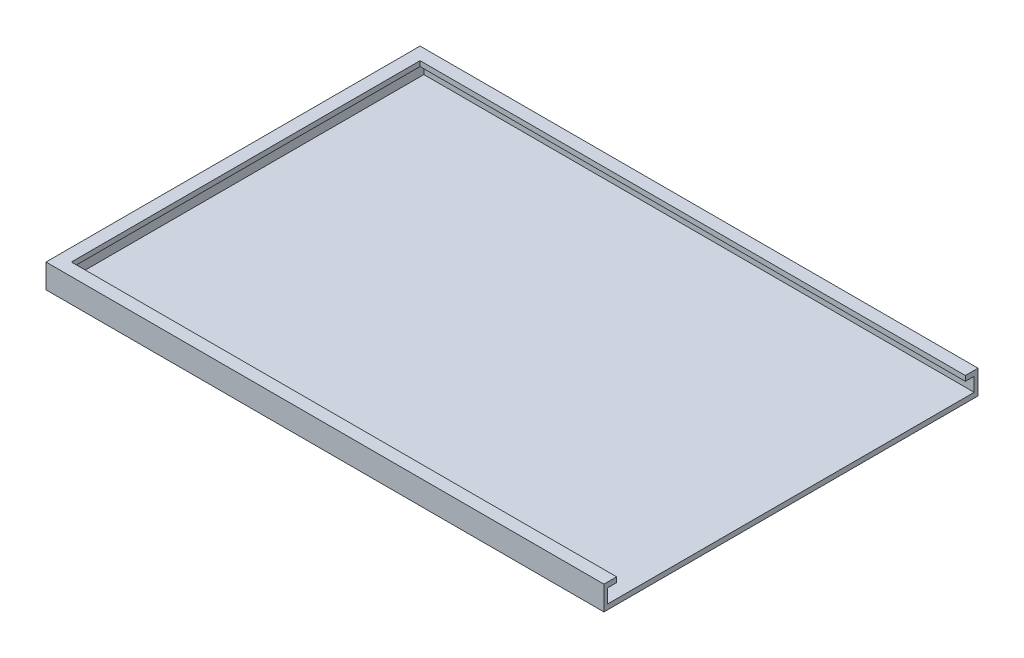
ISO-10303-21;
HEADER;
FILE_DESCRIPTION(('STEP AP214'),'2;1');
FILE_NAME('part.step','',(''),(''),'','','');
FILE_SCHEMA(('AUTOMOTIVE_DESIGN { 1 0 10303 214 1 1 1 1 }'));
ENDSEC;
DATA;
#1=APPLICATION_CONTEXT('core data for automotive mechanical design processes');
#2=APPLICATION_PROTOCOL_DEFINITION('international standard','automotive_design',2000,#1);
#3=PRODUCT_CONTEXT('',#1,'mechanical');
#4=PRODUCT('Part','Part','',(#3));
#5=PRODUCT_RELATED_PRODUCT_CATEGORY('part','',(#4));
#6=PRODUCT_DEFINITION_FORMATION('','',#4);
#7=PRODUCT_DEFINITION_CONTEXT('part definition',#1,'design');
#8=PRODUCT_DEFINITION('design','',#6,#7);
#9=PRODUCT_DEFINITION_SHAPE('','',#8);
#10=(LENGTH_UNIT() NAMED_UNIT(*) SI_UNIT(.MILLI.,.METRE.));
#11=(NAMED_UNIT(*) PLANE_ANGLE_UNIT() SI_UNIT($,.RADIAN.));
#12=(NAMED_UNIT(*) SI_UNIT($,.STERADIAN.) SOLID_ANGLE_UNIT());
#13=UNCERTAINTY_MEASURE_WITH_UNIT(LENGTH_MEASURE(1.E-05),#10,'distance_accuracy_value','');
#14=(GEOMETRIC_REPRESENTATION_CONTEXT(3) GLOBAL_UNCERTAINTY_ASSIGNED_CONTEXT((#13)) GLOBAL_UNIT_ASSIGNED_CONTEXT((#10,
#11,#12)) REPRESENTATION_CONTEXT('',''));
#15=CARTESIAN_POINT('',(0.,0.,0.));
#16=DIRECTION('',(0.,0.,1.));
#17=DIRECTION('',(1.,0.,0.));
#18=AXIS2_PLACEMENT_3D('',#15,#16,#17);
#19=CARTESIAN_POINT('',(43.,0.8,27.5));
#20=DIRECTION('',(-1.,0.,0.));
#21=DIRECTION('',(0.,0.,1.));
#22=AXIS2_PLACEMENT_3D('',#19,#20,#21);
#23=PLANE('',#22);
#24=DIRECTION('',(0.,0.,-1.));
#25=VECTOR('',#24,1.);
#26=CARTESIAN_POINT('',(43.,3.,28.9));
#27=LINE('',#26,#25);
#28=CARTESIAN_POINT('',(43.,3.,28.9));
#29=VERTEX_POINT('',#28);
#30=CARTESIAN_POINT('',(43.,3.,27.5));
#31=VERTEX_POINT('',#30);
#32=EDGE_CURVE('E176',#29,#31,#27,.T.);
#33=ORIENTED_EDGE('',*,*,#32,.T.);
#34=DIRECTION('',(0.,-1.,0.));
#35=VECTOR('',#34,1.);
#36=CARTESIAN_POINT('',(43.,0.,27.5));
#37=LINE('',#36,#35);
#38=CARTESIAN_POINT('',(43.,3.79999999999998,27.5));
#39=VERTEX_POINT('',#38);
#40=EDGE_CURVE('E182',#39,#31,#37,.T.);
#41=ORIENTED_EDGE('',*,*,#40,.F.);
#42=DIRECTION('',(0.,0.,-1.));
#43=VECTOR('',#42,1.);
#44=CARTESIAN_POINT('',(43.,3.79999999999998,29.5));
#45=LINE('',#44,#43);
#46=CARTESIAN_POINT('',(43.,3.79999999999998,29.5));
#47=VERTEX_POINT('',#46);
#48=EDGE_CURVE('E199',#47,#39,#45,.T.);
#49=ORIENTED_EDGE('',*,*,#48,.F.);
#50=DIRECTION('',(0.,-1.,0.));
#51=VECTOR('',#50,1.);
#52=CARTESIAN_POINT('',(43.,0.,29.5));
#53=LINE('',#52,#51);
#54=CARTESIAN_POINT('',(43.,0.,29.5));
#55=VERTEX_POINT('',#54);
#56=EDGE_CURVE('E183',#47,#55,#53,.T.);
#57=ORIENTED_EDGE('',*,*,#56,.T.);
#58=DIRECTION('',(0.,0.,-1.));
#59=VECTOR('',#58,1.);
#60=CARTESIAN_POINT('',(43.,0.,27.5));
#61=LINE('',#60,#59);
#62=CARTESIAN_POINT('',(43.,0.,-29.5));
#63=VERTEX_POINT('',#62);
#64=EDGE_CURVE('E253',#55,#63,#61,.T.);
#65=ORIENTED_EDGE('',*,*,#64,.T.);
#66=DIRECTION('',(0.,-1.,0.));
#67=VECTOR('',#66,1.);
#68=CARTESIAN_POINT('',(43.,0.,-29.5));
#69=LINE('',#68,#67);
#70=CARTESIAN_POINT('',(43.,3.79999999999998,-29.5));
#71=VERTEX_POINT('',#70);
#72=EDGE_CURVE('E225',#71,#63,#69,.T.);
#73=ORIENTED_EDGE('',*,*,#72,.F.);
#74=DIRECTION('',(0.,0.,1.));
#75=VECTOR('',#74,1.);
#76=CARTESIAN_POINT('',(43.,3.79999999999998,-29.5));
#77=LINE('',#76,#75);
#78=CARTESIAN_POINT('',(43.,3.79999999999998,-27.5));
#79=VERTEX_POINT('',#78);
#80=EDGE_CURVE('E238',#71,#79,#77,.T.);
#81=ORIENTED_EDGE('',*,*,#80,.T.);
#82=DIRECTION('',(0.,-1.,0.));
#83=VECTOR('',#82,1.);
#84=CARTESIAN_POINT('',(43.,0.,-27.5));
#85=LINE('',#84,#83);
#86=CARTESIAN_POINT('',(43.,3.,-27.5));
#87=VERTEX_POINT('',#86);
#88=EDGE_CURVE('E224',#79,#87,#85,.T.);
#89=ORIENTED_EDGE('',*,*,#88,.T.);
#90=DIRECTION('',(0.,0.,1.));
#91=VECTOR('',#90,1.);
#92=CARTESIAN_POINT('',(43.,3.,-28.9));
#93=LINE('',#92,#91);
#94=CARTESIAN_POINT('',(43.,3.,-28.9));
#95=VERTEX_POINT('',#94);
#96=EDGE_CURVE('E218',#95,#87,#93,.T.);
#97=ORIENTED_EDGE('',*,*,#96,.F.);
#98=DIRECTION('',(0.,1.,0.));
#99=VECTOR('',#98,1.);
#100=CARTESIAN_POINT('',(43.,0.8,-28.9));
#101=LINE('',#100,#99);
#102=CARTESIAN_POINT('',(43.,0.8,-28.9));
#103=VERTEX_POINT('',#102);
#104=EDGE_CURVE('E209',#103,#95,#101,.T.);
#105=ORIENTED_EDGE('',*,*,#104,.F.);
#106=DIRECTION('',(0.,0.,-1.));
#107=VECTOR('',#106,1.);
#108=CARTESIAN_POINT('',(43.,0.8,27.5));
#109=LINE('',#108,#107);
#110=CARTESIAN_POINT('',(43.,0.8,28.9));
#111=VERTEX_POINT('',#110);
#112=EDGE_CURVE('E46',#111,#103,#109,.T.);
#113=ORIENTED_EDGE('',*,*,#112,.F.);
#114=DIRECTION('',(0.,1.,0.));
#115=VECTOR('',#114,1.);
#116=CARTESIAN_POINT('',(43.,0.8,28.9));
#117=LINE('',#116,#115);
#118=EDGE_CURVE('E135',#111,#29,#117,.T.);
#119=ORIENTED_EDGE('',*,*,#118,.T.);
#120=EDGE_LOOP('',(#33,#41,#49,#57,#65,#73,#81,#89,#97,#105,#113,#119));
#121=FACE_BOUND('',#120,.T.);
#122=ADVANCED_FACE('F38',(#121),#23,.F.);
#123=CARTESIAN_POINT('',(0.,0.,27.5));
#124=DIRECTION('',(0.,0.,-1.));
#125=DIRECTION('',(1.,0.,0.));
#126=AXIS2_PLACEMENT_3D('',#123,#124,#125);
#127=PLANE('',#126);
#128=DIRECTION('',(0.,-1.,0.));
#129=VECTOR('',#128,1.);
#130=CARTESIAN_POINT('',(-43.,0.,27.5));
#131=LINE('',#130,#129);
#132=CARTESIAN_POINT('',(-43.,3.79999999999999,27.5));
#133=VERTEX_POINT('',#132);
#134=CARTESIAN_POINT('',(-43.,3.,27.5));
#135=VERTEX_POINT('',#134);
#136=EDGE_CURVE('E61',#133,#135,#131,.T.);
#137=ORIENTED_EDGE('',*,*,#136,.F.);
#138=DIRECTION('',(1.,0.,0.));
#139=VECTOR('',#138,1.);
#140=CARTESIAN_POINT('',(43.,3.79999999999998,27.5));
#141=LINE('',#140,#139);
#142=EDGE_CURVE('E188',#133,#39,#141,.T.);
#143=ORIENTED_EDGE('',*,*,#142,.T.);
#144=ORIENTED_EDGE('',*,*,#40,.T.);
#145=DIRECTION('',(-1.,0.,0.));
#146=VECTOR('',#145,1.);
#147=CARTESIAN_POINT('',(43.,3.,27.5));
#148=LINE('',#147,#146);
#149=EDGE_CURVE('E171',#31,#135,#148,.T.);
#150=ORIENTED_EDGE('',*,*,#149,.T.);
#151=EDGE_LOOP('',(#137,#143,#144,#150));
#152=FACE_BOUND('',#151,.T.);
#153=ADVANCED_FACE('F283',(#152),#127,.T.);
#154=CARTESIAN_POINT('',(0.,0.8,0.));
#155=DIRECTION('',(0.,-1.,0.));
#156=DIRECTION('',(0.,0.,-1.));
#157=AXIS2_PLACEMENT_3D('',#154,#155,#156);
#158=PLANE('',#157);
#159=DIRECTION('',(1.,0.,0.));
#160=VECTOR('',#159,1.);
#161=CARTESIAN_POINT('',(43.,0.8,-28.9));
#162=LINE('',#161,#160);
#163=CARTESIAN_POINT('',(-43.8,0.8,-28.9));
#164=VERTEX_POINT('',#163);
#165=EDGE_CURVE('E145',#164,#103,#162,.T.);
#166=ORIENTED_EDGE('',*,*,#165,.F.);
#167=DIRECTION('',(0.,0.,-1.));
#168=VECTOR('',#167,1.);
#169=CARTESIAN_POINT('',(-43.8,0.8,28.9));
#170=LINE('',#169,#168);
#171=CARTESIAN_POINT('',(-43.8,0.8,28.9));
#172=VERTEX_POINT('',#171);
#173=EDGE_CURVE('E143',#172,#164,#170,.T.);
#174=ORIENTED_EDGE('',*,*,#173,.F.);
#175=DIRECTION('',(1.,0.,0.));
#176=VECTOR('',#175,1.);
#177=CARTESIAN_POINT('',(43.,0.8,28.9));
#178=LINE('',#177,#176);
#179=EDGE_CURVE('E128',#172,#111,#178,.T.);
#180=ORIENTED_EDGE('',*,*,#179,.T.);
#181=ORIENTED_EDGE('',*,*,#112,.T.);
#182=EDGE_LOOP('',(#166,#174,#180,#181));
#183=FACE_BOUND('',#182,.T.);
#184=ADVANCED_FACE('F144',(#183),#158,.F.);
#185=CARTESIAN_POINT('',(0.,0.,0.));
#186=DIRECTION('',(0.,-1.,0.));
#187=DIRECTION('',(0.,0.,-1.));
#188=AXIS2_PLACEMENT_3D('',#185,#186,#187);
#189=PLANE('',#188);
#190=DIRECTION('',(-1.,0.,0.));
#191=VECTOR('',#190,1.);
#192=CARTESIAN_POINT('',(43.,0.,29.5));
#193=LINE('',#192,#191);
#194=CARTESIAN_POINT('',(-45.,0.,29.5));
#195=VERTEX_POINT('',#194);
#196=EDGE_CURVE('E195',#55,#195,#193,.T.);
#197=ORIENTED_EDGE('',*,*,#196,.T.);
#198=DIRECTION('',(0.,0.,1.));
#199=VECTOR('',#198,1.);
#200=CARTESIAN_POINT('',(-45.,0.,-29.5));
#201=LINE('',#200,#199);
#202=CARTESIAN_POINT('',(-45.,0.,-29.5));
#203=VERTEX_POINT('',#202);
#204=EDGE_CURVE('E250',#203,#195,#201,.T.);
#205=ORIENTED_EDGE('',*,*,#204,.F.);
#206=DIRECTION('',(-1.,0.,0.));
#207=VECTOR('',#206,1.);
#208=CARTESIAN_POINT('',(43.,0.,-29.5));
#209=LINE('',#208,#207);
#210=EDGE_CURVE('E229',#63,#203,#209,.T.);
#211=ORIENTED_EDGE('',*,*,#210,.F.);
#212=ORIENTED_EDGE('',*,*,#64,.F.);
#213=EDGE_LOOP('',(#197,#205,#211,#212));
#214=FACE_BOUND('',#213,.T.);
#215=ADVANCED_FACE('F264',(#214),#189,.T.);
#216=CARTESIAN_POINT('',(0.,0.,-27.5));
#217=DIRECTION('',(0.,0.,1.));
#218=DIRECTION('',(1.,0.,0.));
#219=AXIS2_PLACEMENT_3D('',#216,#217,#218);
#220=PLANE('',#219);
#221=DIRECTION('',(0.,1.,0.));
#222=VECTOR('',#221,1.);
#223=CARTESIAN_POINT('',(-43.,0.,-27.5));
#224=LINE('',#223,#222);
#225=CARTESIAN_POINT('',(-43.,3.,-27.5));
#226=VERTEX_POINT('',#225);
#227=CARTESIAN_POINT('',(-43.,3.79999999999999,-27.5));
#228=VERTEX_POINT('',#227);
#229=EDGE_CURVE('E168',#226,#228,#224,.T.);
#230=ORIENTED_EDGE('',*,*,#229,.F.);
#231=DIRECTION('',(-1.,0.,0.));
#232=VECTOR('',#231,1.);
#233=CARTESIAN_POINT('',(43.,3.,-27.5));
#234=LINE('',#233,#232);
#235=EDGE_CURVE('E208',#87,#226,#234,.T.);
#236=ORIENTED_EDGE('',*,*,#235,.F.);
#237=ORIENTED_EDGE('',*,*,#88,.F.);
#238=DIRECTION('',(1.,0.,0.));
#239=VECTOR('',#238,1.);
#240=CARTESIAN_POINT('',(43.,3.79999999999998,-27.5));
#241=LINE('',#240,#239);
#242=EDGE_CURVE('E53',#228,#79,#241,.T.);
#243=ORIENTED_EDGE('',*,*,#242,.F.);
#244=EDGE_LOOP('',(#230,#236,#237,#243));
#245=FACE_BOUND('',#244,.T.);
#246=ADVANCED_FACE('F275',(#245),#220,.T.);
#247=CARTESIAN_POINT('',(-45.,0.,-29.5));
#248=DIRECTION('',(1.,0.,0.));
#249=DIRECTION('',(0.,0.,-1.));
#250=AXIS2_PLACEMENT_3D('',#247,#248,#249);
#251=PLANE('',#250);
#252=ORIENTED_EDGE('',*,*,#204,.T.);
#253=DIRECTION('',(0.,1.,0.));
#254=VECTOR('',#253,1.);
#255=CARTESIAN_POINT('',(-45.,0.,29.5));
#256=LINE('',#255,#254);
#257=CARTESIAN_POINT('',(-45.,3.79999999999999,29.5));
#258=VERTEX_POINT('',#257);
#259=EDGE_CURVE('E191',#195,#258,#256,.T.);
#260=ORIENTED_EDGE('',*,*,#259,.T.);
#261=DIRECTION('',(0.,0.,1.));
#262=VECTOR('',#261,1.);
#263=CARTESIAN_POINT('',(-45.,3.79999999999999,-29.5));
#264=LINE('',#263,#262);
#265=CARTESIAN_POINT('',(-45.,3.79999999999999,-29.5));
#266=VERTEX_POINT('',#265);
#267=EDGE_CURVE('E247',#266,#258,#264,.T.);
#268=ORIENTED_EDGE('',*,*,#267,.F.);
#269=DIRECTION('',(0.,1.,0.));
#270=VECTOR('',#269,1.);
#271=CARTESIAN_POINT('',(-45.,0.,-29.5));
#272=LINE('',#271,#270);
#273=EDGE_CURVE('E232',#203,#266,#272,.T.);
#274=ORIENTED_EDGE('',*,*,#273,.F.);
#275=EDGE_LOOP('',(#252,#260,#268,#274));
#276=FACE_BOUND('',#275,.T.);
#277=ADVANCED_FACE('F290',(#276),#251,.F.);
#278=CARTESIAN_POINT('',(43.,3.79999999999998,-29.5));
#279=DIRECTION('',(0.,-1.,0.));
#280=DIRECTION('',(1.,0.,0.));
#281=AXIS2_PLACEMENT_3D('',#278,#279,#280);
#282=PLANE('',#281);
#283=ORIENTED_EDGE('',*,*,#80,.F.);
#284=DIRECTION('',(1.,0.,0.));
#285=VECTOR('',#284,1.);
#286=CARTESIAN_POINT('',(43.,3.79999999999998,-29.5));
#287=LINE('',#286,#285);
#288=EDGE_CURVE('E235',#266,#71,#287,.T.);
#289=ORIENTED_EDGE('',*,*,#288,.F.);
#290=ORIENTED_EDGE('',*,*,#267,.T.);
#291=DIRECTION('',(1.,0.,0.));
#292=VECTOR('',#291,1.);
#293=CARTESIAN_POINT('',(43.,3.79999999999998,29.5));
#294=LINE('',#293,#292);
#295=EDGE_CURVE('E187',#258,#47,#294,.T.);
#296=ORIENTED_EDGE('',*,*,#295,.T.);
#297=ORIENTED_EDGE('',*,*,#48,.T.);
#298=ORIENTED_EDGE('',*,*,#142,.F.);
#299=DIRECTION('',(0.,0.,-1.));
#300=VECTOR('',#299,1.);
#301=CARTESIAN_POINT('',(-43.,3.79999999999999,-29.5));
#302=LINE('',#301,#300);
#303=EDGE_CURVE('E162',#133,#228,#302,.T.);
#304=ORIENTED_EDGE('',*,*,#303,.T.);
#305=ORIENTED_EDGE('',*,*,#242,.T.);
#306=EDGE_LOOP('',(#283,#289,#290,#296,#297,#298,#304,#305));
#307=FACE_BOUND('',#306,.T.);
#308=ADVANCED_FACE('F272',(#307),#282,.F.);
#309=CARTESIAN_POINT('',(0.,0.,-29.5));
#310=DIRECTION('',(0.,0.,1.));
#311=DIRECTION('',(1.,0.,0.));
#312=AXIS2_PLACEMENT_3D('',#309,#310,#311);
#313=PLANE('',#312);
#314=ORIENTED_EDGE('',*,*,#210,.T.);
#315=ORIENTED_EDGE('',*,*,#273,.T.);
#316=ORIENTED_EDGE('',*,*,#288,.T.);
#317=ORIENTED_EDGE('',*,*,#72,.T.);
#318=EDGE_LOOP('',(#314,#315,#316,#317));
#319=FACE_BOUND('',#318,.T.);
#320=ADVANCED_FACE('F267',(#319),#313,.F.);
#321=CARTESIAN_POINT('',(43.,3.,-28.9));
#322=DIRECTION('',(0.,1.,0.));
#323=DIRECTION('',(-1.,0.,0.));
#324=AXIS2_PLACEMENT_3D('',#321,#322,#323);
#325=PLANE('',#324);
#326=ORIENTED_EDGE('',*,*,#235,.T.);
#327=DIRECTION('',(0.,0.,1.));
#328=VECTOR('',#327,1.);
#329=CARTESIAN_POINT('',(-43.,3.,0.));
#330=LINE('',#329,#328);
#331=EDGE_CURVE('E11',#226,#135,#330,.T.);
#332=ORIENTED_EDGE('',*,*,#331,.T.);
#333=ORIENTED_EDGE('',*,*,#149,.F.);
#334=ORIENTED_EDGE('',*,*,#32,.F.);
#335=DIRECTION('',(-1.,0.,0.));
#336=VECTOR('',#335,1.);
#337=CARTESIAN_POINT('',(43.,3.,28.9));
#338=LINE('',#337,#336);
#339=CARTESIAN_POINT('',(-43.8,3.,28.9));
#340=VERTEX_POINT('',#339);
#341=EDGE_CURVE('E140',#29,#340,#338,.T.);
#342=ORIENTED_EDGE('',*,*,#341,.T.);
#343=DIRECTION('',(0.,0.,1.));
#344=VECTOR('',#343,1.);
#345=CARTESIAN_POINT('',(-43.8,3.,28.9));
#346=LINE('',#345,#344);
#347=CARTESIAN_POINT('',(-43.8,3.,-28.9));
#348=VERTEX_POINT('',#347);
#349=EDGE_CURVE('E154',#348,#340,#346,.T.);
#350=ORIENTED_EDGE('',*,*,#349,.F.);
#351=DIRECTION('',(-1.,0.,0.));
#352=VECTOR('',#351,1.);
#353=CARTESIAN_POINT('',(43.,3.,-28.9));
#354=LINE('',#353,#352);
#355=EDGE_CURVE('E213',#95,#348,#354,.T.);
#356=ORIENTED_EDGE('',*,*,#355,.F.);
#357=ORIENTED_EDGE('',*,*,#96,.T.);
#358=EDGE_LOOP('',(#326,#332,#333,#334,#342,#350,#356,#357));
#359=FACE_BOUND('',#358,.T.);
#360=ADVANCED_FACE('F277',(#359),#325,.F.);
#361=CARTESIAN_POINT('',(0.,0.,-28.9));
#362=DIRECTION('',(0.,0.,1.));
#363=DIRECTION('',(1.,0.,0.));
#364=AXIS2_PLACEMENT_3D('',#361,#362,#363);
#365=PLANE('',#364);
#366=ORIENTED_EDGE('',*,*,#355,.T.);
#367=DIRECTION('',(0.,1.,0.));
#368=VECTOR('',#367,1.);
#369=CARTESIAN_POINT('',(-43.8,3.,-28.9));
#370=LINE('',#369,#368);
#371=EDGE_CURVE('E150',#164,#348,#370,.T.);
#372=ORIENTED_EDGE('',*,*,#371,.F.);
#373=ORIENTED_EDGE('',*,*,#165,.T.);
#374=ORIENTED_EDGE('',*,*,#104,.T.);
#375=EDGE_LOOP('',(#366,#372,#373,#374));
#376=FACE_BOUND('',#375,.T.);
#377=ADVANCED_FACE('F280',(#376),#365,.T.);
#378=CARTESIAN_POINT('',(0.,0.,29.5));
#379=DIRECTION('',(0.,0.,-1.));
#380=DIRECTION('',(1.,0.,0.));
#381=AXIS2_PLACEMENT_3D('',#378,#379,#380);
#382=PLANE('',#381);
#383=ORIENTED_EDGE('',*,*,#56,.F.);
#384=ORIENTED_EDGE('',*,*,#295,.F.);
#385=ORIENTED_EDGE('',*,*,#259,.F.);
#386=ORIENTED_EDGE('',*,*,#196,.F.);
#387=EDGE_LOOP('',(#383,#384,#385,#386));
#388=FACE_BOUND('',#387,.T.);
#389=ADVANCED_FACE('F287',(#388),#382,.F.);
#390=CARTESIAN_POINT('',(0.,0.,28.9));
#391=DIRECTION('',(0.,0.,-1.));
#392=DIRECTION('',(1.,0.,0.));
#393=AXIS2_PLACEMENT_3D('',#390,#391,#392);
#394=PLANE('',#393);
#395=ORIENTED_EDGE('',*,*,#179,.F.);
#396=DIRECTION('',(0.,-1.,0.));
#397=VECTOR('',#396,1.);
#398=CARTESIAN_POINT('',(-43.8,3.,28.9));
#399=LINE('',#398,#397);
#400=EDGE_CURVE('E132',#340,#172,#399,.T.);
#401=ORIENTED_EDGE('',*,*,#400,.F.);
#402=ORIENTED_EDGE('',*,*,#341,.F.);
#403=ORIENTED_EDGE('',*,*,#118,.F.);
#404=EDGE_LOOP('',(#395,#401,#402,#403));
#405=FACE_BOUND('',#404,.T.);
#406=ADVANCED_FACE('F130',(#405),#394,.T.);
#407=CARTESIAN_POINT('',(-43.,0.,0.));
#408=DIRECTION('',(1.,0.,0.));
#409=DIRECTION('',(0.,0.,-1.));
#410=AXIS2_PLACEMENT_3D('',#407,#408,#409);
#411=PLANE('',#410);
#412=ORIENTED_EDGE('',*,*,#331,.F.);
#413=ORIENTED_EDGE('',*,*,#229,.T.);
#414=ORIENTED_EDGE('',*,*,#303,.F.);
#415=ORIENTED_EDGE('',*,*,#136,.T.);
#416=EDGE_LOOP('',(#412,#413,#414,#415));
#417=FACE_BOUND('',#416,.T.);
#418=ADVANCED_FACE('F340',(#417),#411,.T.);
#419=CARTESIAN_POINT('',(-43.8,0.,0.));
#420=DIRECTION('',(1.,0.,0.));
#421=DIRECTION('',(0.,0.,-1.));
#422=AXIS2_PLACEMENT_3D('',#419,#420,#421);
#423=PLANE('',#422);
#424=ORIENTED_EDGE('',*,*,#400,.T.);
#425=ORIENTED_EDGE('',*,*,#173,.T.);
#426=ORIENTED_EDGE('',*,*,#371,.T.);
#427=ORIENTED_EDGE('',*,*,#349,.T.);
#428=EDGE_LOOP('',(#424,#425,#426,#427));
#429=FACE_BOUND('',#428,.T.);
#430=ADVANCED_FACE('F152',(#429),#423,.T.);
#431=CLOSED_SHELL('',(#122,#153,#184,#215,#246,#277,#308,#320,#360,#377,#389,#406,#418,#430));
#432=MANIFOLD_SOLID_BREP('B2',#431);
#433=ADVANCED_BREP_SHAPE_REPRESENTATION('',(#18,#432),#14);
#434=SHAPE_DEFINITION_REPRESENTATION(#9,#433);
ENDSEC;
END-ISO-10303-21;
